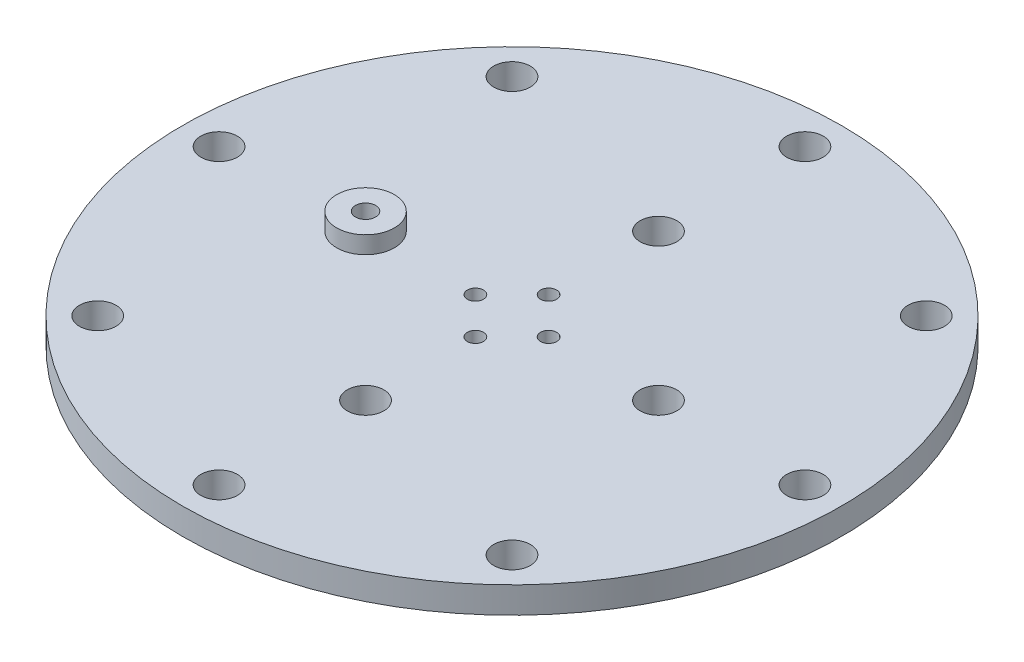
ISO-10303-21;
HEADER;
FILE_DESCRIPTION(('STEP AP214'),'2;1');
FILE_NAME('part.step','',(''),(''),'','','');
FILE_SCHEMA(('AUTOMOTIVE_DESIGN { 1 0 10303 214 1 1 1 1 }'));
ENDSEC;
DATA;
#1=APPLICATION_CONTEXT('core data for automotive mechanical design processes');
#2=APPLICATION_PROTOCOL_DEFINITION('international standard','automotive_design',2000,#1);
#3=PRODUCT_CONTEXT('',#1,'mechanical');
#4=PRODUCT('Part','Part','',(#3));
#5=PRODUCT_RELATED_PRODUCT_CATEGORY('part','',(#4));
#6=PRODUCT_DEFINITION_FORMATION('','',#4);
#7=PRODUCT_DEFINITION_CONTEXT('part definition',#1,'design');
#8=PRODUCT_DEFINITION('design','',#6,#7);
#9=PRODUCT_DEFINITION_SHAPE('','',#8);
#10=(LENGTH_UNIT() NAMED_UNIT(*) SI_UNIT(.MILLI.,.METRE.));
#11=(NAMED_UNIT(*) PLANE_ANGLE_UNIT() SI_UNIT($,.RADIAN.));
#12=(NAMED_UNIT(*) SI_UNIT($,.STERADIAN.) SOLID_ANGLE_UNIT());
#13=UNCERTAINTY_MEASURE_WITH_UNIT(LENGTH_MEASURE(1.E-05),#10,'distance_accuracy_value','');
#14=(GEOMETRIC_REPRESENTATION_CONTEXT(3) GLOBAL_UNCERTAINTY_ASSIGNED_CONTEXT((#13)) GLOBAL_UNIT_ASSIGNED_CONTEXT((#10,
#11,#12)) REPRESENTATION_CONTEXT('',''));
#15=CARTESIAN_POINT('',(0.,0.,0.));
#16=DIRECTION('',(0.,0.,1.));
#17=DIRECTION('',(1.,0.,0.));
#18=AXIS2_PLACEMENT_3D('',#15,#16,#17);
#19=CARTESIAN_POINT('',(-25.4,2.572,-2.66050878019847E-13));
#20=DIRECTION('',(0.,1.,0.));
#21=DIRECTION('',(0.,0.,1.));
#22=AXIS2_PLACEMENT_3D('',#19,#20,#21);
#23=CYLINDRICAL_SURFACE('',#22,2.75);
#24=CARTESIAN_POINT('',(-25.4,2.572,-2.66050878019847E-13));
#25=DIRECTION('',(0.,1.,0.));
#26=DIRECTION('',(0.,0.,1.));
#27=AXIS2_PLACEMENT_3D('',#24,#25,#26);
#28=CIRCLE('',#27,2.75);
#29=CARTESIAN_POINT('',(-25.4,2.572,2.74999999999973));
#30=VERTEX_POINT('',#29);
#31=EDGE_CURVE('E11',#30,#30,#28,.T.);
#32=ORIENTED_EDGE('',*,*,#31,.T.);
#33=EDGE_LOOP('',(#32));
#34=FACE_BOUND('',#33,.T.);
#35=CARTESIAN_POINT('',(-25.4,4.572,-2.66050878019847E-13));
#36=DIRECTION('',(0.,1.,0.));
#37=DIRECTION('',(0.,0.,1.));
#38=AXIS2_PLACEMENT_3D('',#35,#36,#37);
#39=CIRCLE('',#38,2.75);
#40=CARTESIAN_POINT('',(-25.4,4.572,2.74999999999973));
#41=VERTEX_POINT('',#40);
#42=EDGE_CURVE('E48',#41,#41,#39,.T.);
#43=ORIENTED_EDGE('',*,*,#42,.F.);
#44=EDGE_LOOP('',(#43));
#45=FACE_BOUND('',#44,.T.);
#46=ADVANCED_FACE('F45',(#34,#45),#23,.T.);
#47=CARTESIAN_POINT('',(-25.4,2.572,-2.66050878019847E-13));
#48=DIRECTION('',(0.,1.,0.));
#49=DIRECTION('',(0.,0.,1.));
#50=AXIS2_PLACEMENT_3D('',#47,#48,#49);
#51=PLANE('',#50);
#52=CARTESIAN_POINT('',(-25.4,2.572,-2.66050878019847E-13));
#53=DIRECTION('',(0.,1.,0.));
#54=DIRECTION('',(0.,0.,1.));
#55=AXIS2_PLACEMENT_3D('',#52,#53,#54);
#56=CIRCLE('',#55,1.75);
#57=CARTESIAN_POINT('',(-25.4,2.572,1.74999999999973));
#58=VERTEX_POINT('',#57);
#59=EDGE_CURVE('E55',#58,#58,#56,.T.);
#60=ORIENTED_EDGE('',*,*,#59,.T.);
#61=EDGE_LOOP('',(#60));
#62=FACE_BOUND('',#61,.T.);
#63=ORIENTED_EDGE('',*,*,#31,.F.);
#64=EDGE_LOOP('',(#63));
#65=FACE_BOUND('',#64,.T.);
#66=ADVANCED_FACE('F83',(#62,#65),#51,.F.);
#67=CARTESIAN_POINT('',(-25.4,2.572,-2.66050878019847E-13));
#68=DIRECTION('',(0.,1.,0.));
#69=DIRECTION('',(0.,0.,1.));
#70=AXIS2_PLACEMENT_3D('',#67,#68,#69);
#71=CYLINDRICAL_SURFACE('',#70,1.75);
#72=ORIENTED_EDGE('',*,*,#59,.F.);
#73=EDGE_LOOP('',(#72));
#74=FACE_BOUND('',#73,.T.);
#75=CARTESIAN_POINT('',(-25.4,7.572,-2.66050878019847E-13));
#76=DIRECTION('',(0.,1.,0.));
#77=DIRECTION('',(0.,0.,1.));
#78=AXIS2_PLACEMENT_3D('',#75,#76,#77);
#79=CIRCLE('',#78,1.75);
#80=CARTESIAN_POINT('',(-25.4,7.572,1.74999999999973));
#81=VERTEX_POINT('',#80);
#82=EDGE_CURVE('E63',#81,#81,#79,.T.);
#83=ORIENTED_EDGE('',*,*,#82,.T.);
#84=EDGE_LOOP('',(#83));
#85=FACE_BOUND('',#84,.T.);
#86=ADVANCED_FACE('F69',(#74,#85),#71,.F.);
#87=CARTESIAN_POINT('',(-25.4,7.572,-2.66050878019847E-13));
#88=DIRECTION('',(0.,1.,0.));
#89=DIRECTION('',(0.,0.,1.));
#90=AXIS2_PLACEMENT_3D('',#87,#88,#89);
#91=PLANE('',#90);
#92=CARTESIAN_POINT('',(-25.4,7.572,-2.66050878019847E-13));
#93=DIRECTION('',(0.,1.,0.));
#94=DIRECTION('',(0.,0.,1.));
#95=AXIS2_PLACEMENT_3D('',#92,#93,#94);
#96=CIRCLE('',#95,5.);
#97=CARTESIAN_POINT('',(-25.4,7.572,4.99999999999973));
#98=VERTEX_POINT('',#97);
#99=EDGE_CURVE('E59',#98,#98,#96,.T.);
#100=ORIENTED_EDGE('',*,*,#99,.T.);
#101=EDGE_LOOP('',(#100));
#102=FACE_BOUND('',#101,.T.);
#103=ORIENTED_EDGE('',*,*,#82,.F.);
#104=EDGE_LOOP('',(#103));
#105=FACE_BOUND('',#104,.T.);
#106=ADVANCED_FACE('F71',(#102,#105),#91,.T.);
#107=CARTESIAN_POINT('',(-25.4,4.572,-2.66050878019847E-13));
#108=DIRECTION('',(0.,1.,0.));
#109=DIRECTION('',(0.,0.,1.));
#110=AXIS2_PLACEMENT_3D('',#107,#108,#109);
#111=PLANE('',#110);
#112=ORIENTED_EDGE('',*,*,#42,.T.);
#113=EDGE_LOOP('',(#112));
#114=FACE_BOUND('',#113,.T.);
#115=CARTESIAN_POINT('',(-25.4,4.572,-2.66050878019847E-13));
#116=DIRECTION('',(0.,1.,0.));
#117=DIRECTION('',(0.,0.,1.));
#118=AXIS2_PLACEMENT_3D('',#115,#116,#117);
#119=CIRCLE('',#118,5.);
#120=CARTESIAN_POINT('',(-25.4,4.572,4.99999999999973));
#121=VERTEX_POINT('',#120);
#122=EDGE_CURVE('E60',#121,#121,#119,.T.);
#123=ORIENTED_EDGE('',*,*,#122,.F.);
#124=EDGE_LOOP('',(#123));
#125=FACE_BOUND('',#124,.T.);
#126=ADVANCED_FACE('F73',(#114,#125),#111,.F.);
#127=CARTESIAN_POINT('',(-25.4,7.572,-2.66050878019847E-13));
#128=DIRECTION('',(0.,-1.,0.));
#129=DIRECTION('',(0.,0.,-1.));
#130=AXIS2_PLACEMENT_3D('',#127,#128,#129);
#131=CYLINDRICAL_SURFACE('',#130,5.);
#132=ORIENTED_EDGE('',*,*,#99,.F.);
#133=EDGE_LOOP('',(#132));
#134=FACE_BOUND('',#133,.T.);
#135=ORIENTED_EDGE('',*,*,#122,.T.);
#136=EDGE_LOOP('',(#135));
#137=FACE_BOUND('',#136,.T.);
#138=ADVANCED_FACE('F80',(#134,#137),#131,.T.);
#139=CLOSED_SHELL('',(#46,#66,#86,#106,#126,#138));
#140=MANIFOLD_SOLID_BREP('B2',#139);
#141=CARTESIAN_POINT('',(0.,4.572,0.));
#142=DIRECTION('',(0.,1.,0.));
#143=DIRECTION('',(0.,0.,1.));
#144=AXIS2_PLACEMENT_3D('',#141,#142,#143);
#145=PLANE('',#144);
#146=CARTESIAN_POINT('',(-50.7999999999978,4.572,2.16262365572695E-12));
#147=DIRECTION('',(0.,1.,0.));
#148=DIRECTION('',(0.,0.,1.));
#149=AXIS2_PLACEMENT_3D('',#146,#147,#148);
#150=CIRCLE('',#149,3.17500000000321);
#151=CARTESIAN_POINT('',(-50.7999999999978,4.572,3.17500000000537));
#152=VERTEX_POINT('',#151);
#153=EDGE_CURVE('E234',#152,#152,#150,.T.);
#154=ORIENTED_EDGE('',*,*,#153,.F.);
#155=EDGE_LOOP('',(#154));
#156=FACE_BOUND('',#155,.T.);
#157=CARTESIAN_POINT('',(4.31280489997456E-12,4.572,50.8));
#158=DIRECTION('',(0.,1.,0.));
#159=DIRECTION('',(0.,0.,1.));
#160=AXIS2_PLACEMENT_3D('',#157,#158,#159);
#161=CIRCLE('',#160,3.17500000000446);
#162=CARTESIAN_POINT('',(4.31280489997456E-12,4.572,53.9750000000045));
#163=VERTEX_POINT('',#162);
#164=EDGE_CURVE('E222',#163,#163,#161,.T.);
#165=ORIENTED_EDGE('',*,*,#164,.F.);
#166=EDGE_LOOP('',(#165));
#167=FACE_BOUND('',#166,.T.);
#168=CARTESIAN_POINT('',(50.8000000000022,4.572,-2.15640244998728E-12));
#169=DIRECTION('',(0.,1.,0.));
#170=DIRECTION('',(0.,0.,1.));
#171=AXIS2_PLACEMENT_3D('',#168,#169,#170);
#172=CIRCLE('',#171,3.1750000000016);
#173=CARTESIAN_POINT('',(50.8000000000022,4.572,3.17499999999944));
#174=VERTEX_POINT('',#173);
#175=EDGE_CURVE('E210',#174,#174,#172,.T.);
#176=ORIENTED_EDGE('',*,*,#175,.F.);
#177=EDGE_LOOP('',(#176));
#178=FACE_BOUND('',#177,.T.);
#179=CARTESIAN_POINT('',(-6.35,4.572,0.));
#180=DIRECTION('',(0.,1.,0.));
#181=DIRECTION('',(0.,0.,1.));
#182=AXIS2_PLACEMENT_3D('',#179,#180,#181);
#183=CIRCLE('',#182,1.397);
#184=CARTESIAN_POINT('',(-6.35,4.572,1.39699999999993));
#185=VERTEX_POINT('',#184);
#186=EDGE_CURVE('E198',#185,#185,#183,.T.);
#187=ORIENTED_EDGE('',*,*,#186,.F.);
#188=EDGE_LOOP('',(#187));
#189=FACE_BOUND('',#188,.T.);
#190=CARTESIAN_POINT('',(6.35,4.572,0.));
#191=DIRECTION('',(0.,1.,0.));
#192=DIRECTION('',(0.,0.,1.));
#193=AXIS2_PLACEMENT_3D('',#190,#191,#192);
#194=CIRCLE('',#193,1.397);
#195=CARTESIAN_POINT('',(6.35,4.572,1.39700000000002));
#196=VERTEX_POINT('',#195);
#197=EDGE_CURVE('E186',#196,#196,#194,.T.);
#198=ORIENTED_EDGE('',*,*,#197,.F.);
#199=EDGE_LOOP('',(#198));
#200=FACE_BOUND('',#199,.T.);
#201=CARTESIAN_POINT('',(1.43449103045502E-12,4.572,25.4));
#202=DIRECTION('',(0.,1.,0.));
#203=DIRECTION('',(0.,0.,1.));
#204=AXIS2_PLACEMENT_3D('',#201,#202,#203);
#205=CIRCLE('',#204,3.17500000000154);
#206=CARTESIAN_POINT('',(1.43449103045502E-12,4.572,28.5750000000015));
#207=VERTEX_POINT('',#206);
#208=EDGE_CURVE('E174',#207,#207,#205,.T.);
#209=ORIENTED_EDGE('',*,*,#208,.F.);
#210=EDGE_LOOP('',(#209));
#211=FACE_BOUND('',#210,.T.);
#212=CARTESIAN_POINT('',(0.,4.572,-50.8));
#213=DIRECTION('',(0.,1.,0.));
#214=DIRECTION('',(0.,0.,1.));
#215=AXIS2_PLACEMENT_3D('',#212,#213,#214);
#216=CIRCLE('',#215,3.175);
#217=CARTESIAN_POINT('',(0.,4.572,-47.625));
#218=VERTEX_POINT('',#217);
#219=EDGE_CURVE('E162',#218,#218,#216,.T.);
#220=ORIENTED_EDGE('',*,*,#219,.F.);
#221=EDGE_LOOP('',(#220));
#222=FACE_BOUND('',#221,.T.);
#223=CARTESIAN_POINT('',(0.,4.572,-6.35));
#224=DIRECTION('',(0.,1.,0.));
#225=DIRECTION('',(0.,0.,1.));
#226=AXIS2_PLACEMENT_3D('',#223,#224,#225);
#227=CIRCLE('',#226,1.397);
#228=CARTESIAN_POINT('',(0.,4.572,-4.953));
#229=VERTEX_POINT('',#228);
#230=EDGE_CURVE('E151',#229,#229,#227,.T.);
#231=ORIENTED_EDGE('',*,*,#230,.F.);
#232=EDGE_LOOP('',(#231));
#233=FACE_BOUND('',#232,.T.);
#234=CARTESIAN_POINT('',(0.,4.572,0.));
#235=DIRECTION('',(0.,1.,0.));
#236=DIRECTION('',(0.,0.,1.));
#237=AXIS2_PLACEMENT_3D('',#234,#235,#236);
#238=CIRCLE('',#237,57.15);
#239=CARTESIAN_POINT('',(0.,4.572,57.15));
#240=VERTEX_POINT('',#239);
#241=EDGE_CURVE('E44',#240,#240,#238,.T.);
#242=ORIENTED_EDGE('',*,*,#241,.T.);
#243=EDGE_LOOP('',(#242));
#244=FACE_BOUND('',#243,.T.);
#245=CARTESIAN_POINT('',(0.,4.572,-25.4));
#246=DIRECTION('',(0.,1.,0.));
#247=DIRECTION('',(0.,0.,1.));
#248=AXIS2_PLACEMENT_3D('',#245,#246,#247);
#249=CIRCLE('',#248,3.175);
#250=CARTESIAN_POINT('',(0.,4.572,-22.225));
#251=VERTEX_POINT('',#250);
#252=EDGE_CURVE('E156',#251,#251,#249,.T.);
#253=ORIENTED_EDGE('',*,*,#252,.F.);
#254=EDGE_LOOP('',(#253));
#255=FACE_BOUND('',#254,.T.);
#256=CARTESIAN_POINT('',(25.4,4.572,0.));
#257=DIRECTION('',(0.,1.,0.));
#258=DIRECTION('',(0.,0.,1.));
#259=AXIS2_PLACEMENT_3D('',#256,#257,#258);
#260=CIRCLE('',#259,3.175);
#261=CARTESIAN_POINT('',(25.4,4.572,3.17500000000009));
#262=VERTEX_POINT('',#261);
#263=EDGE_CURVE('E168',#262,#262,#260,.T.);
#264=ORIENTED_EDGE('',*,*,#263,.F.);
#265=EDGE_LOOP('',(#264));
#266=FACE_BOUND('',#265,.T.);
#267=CARTESIAN_POINT('',(-25.4,4.572,-2.66050878019847E-13));
#268=DIRECTION('',(0.,1.,0.));
#269=DIRECTION('',(0.,0.,1.));
#270=AXIS2_PLACEMENT_3D('',#267,#268,#269);
#271=CIRCLE('',#270,3.175);
#272=CARTESIAN_POINT('',(-25.4,4.572,3.17499999999973));
#273=VERTEX_POINT('',#272);
#274=EDGE_CURVE('E180',#273,#273,#271,.T.);
#275=ORIENTED_EDGE('',*,*,#274,.F.);
#276=EDGE_LOOP('',(#275));
#277=FACE_BOUND('',#276,.T.);
#278=CARTESIAN_POINT('',(0.,4.572,6.35));
#279=DIRECTION('',(0.,1.,0.));
#280=DIRECTION('',(0.,0.,1.));
#281=AXIS2_PLACEMENT_3D('',#278,#279,#280);
#282=CIRCLE('',#281,1.397);
#283=CARTESIAN_POINT('',(0.,4.572,7.747));
#284=VERTEX_POINT('',#283);
#285=EDGE_CURVE('E192',#284,#284,#282,.T.);
#286=ORIENTED_EDGE('',*,*,#285,.F.);
#287=EDGE_LOOP('',(#286));
#288=FACE_BOUND('',#287,.T.);
#289=CARTESIAN_POINT('',(35.9210244842772,4.572,-35.9210244842781));
#290=DIRECTION('',(0.,1.,0.));
#291=DIRECTION('',(0.,0.,1.));
#292=AXIS2_PLACEMENT_3D('',#289,#290,#291);
#293=CIRCLE('',#292,3.17500000000024);
#294=CARTESIAN_POINT('',(35.9210244842772,4.572,-32.7460244842779));
#295=VERTEX_POINT('',#294);
#296=EDGE_CURVE('E204',#295,#295,#293,.T.);
#297=ORIENTED_EDGE('',*,*,#296,.F.);
#298=EDGE_LOOP('',(#297));
#299=FACE_BOUND('',#298,.T.);
#300=CARTESIAN_POINT('',(35.9210244842803,4.572,35.9210244842751));
#301=DIRECTION('',(0.,1.,0.));
#302=DIRECTION('',(0.,0.,1.));
#303=AXIS2_PLACEMENT_3D('',#300,#301,#302);
#304=CIRCLE('',#303,3.17500000000333);
#305=CARTESIAN_POINT('',(35.9210244842803,4.572,39.0960244842784));
#306=VERTEX_POINT('',#305);
#307=EDGE_CURVE('E216',#306,#306,#304,.T.);
#308=ORIENTED_EDGE('',*,*,#307,.F.);
#309=EDGE_LOOP('',(#308));
#310=FACE_BOUND('',#309,.T.);
#311=CARTESIAN_POINT('',(-35.9210244842729,4.572,35.9210244842781));
#312=DIRECTION('',(0.,1.,0.));
#313=DIRECTION('',(0.,0.,1.));
#314=AXIS2_PLACEMENT_3D('',#311,#312,#313);
#315=CIRCLE('',#314,3.1750000000044);
#316=CARTESIAN_POINT('',(-35.9210244842729,4.572,39.0960244842825));
#317=VERTEX_POINT('',#316);
#318=EDGE_CURVE('E228',#317,#317,#315,.T.);
#319=ORIENTED_EDGE('',*,*,#318,.F.);
#320=EDGE_LOOP('',(#319));
#321=FACE_BOUND('',#320,.T.);
#322=CARTESIAN_POINT('',(-35.921024484276,4.572,-35.9210244842751));
#323=DIRECTION('',(0.,1.,0.));
#324=DIRECTION('',(0.,0.,1.));
#325=AXIS2_PLACEMENT_3D('',#322,#323,#324);
#326=CIRCLE('',#325,3.17500000000165);
#327=CARTESIAN_POINT('',(-35.921024484276,4.572,-32.7460244842734));
#328=VERTEX_POINT('',#327);
#329=EDGE_CURVE('E240',#328,#328,#326,.T.);
#330=ORIENTED_EDGE('',*,*,#329,.F.);
#331=EDGE_LOOP('',(#330));
#332=FACE_BOUND('',#331,.T.);
#333=ADVANCED_FACE('F140',(#156,#167,#178,#189,#200,#211,#222,#233,#244,#255,#266,#277,#288,
#299,#310,#321,#332),#145,.T.);
#334=CARTESIAN_POINT('',(0.,0.,0.));
#335=DIRECTION('',(0.,1.,0.));
#336=DIRECTION('',(0.,0.,1.));
#337=AXIS2_PLACEMENT_3D('',#334,#335,#336);
#338=PLANE('',#337);
#339=CARTESIAN_POINT('',(0.,0.,0.));
#340=DIRECTION('',(0.,1.,0.));
#341=DIRECTION('',(0.,0.,1.));
#342=AXIS2_PLACEMENT_3D('',#339,#340,#341);
#343=CIRCLE('',#342,57.15);
#344=CARTESIAN_POINT('',(0.,0.,57.15));
#345=VERTEX_POINT('',#344);
#346=EDGE_CURVE('E144',#345,#345,#343,.T.);
#347=ORIENTED_EDGE('',*,*,#346,.F.);
#348=EDGE_LOOP('',(#347));
#349=FACE_BOUND('',#348,.T.);
#350=CARTESIAN_POINT('',(0.,0.,-6.35));
#351=DIRECTION('',(0.,1.,0.));
#352=DIRECTION('',(0.,0.,1.));
#353=AXIS2_PLACEMENT_3D('',#350,#351,#352);
#354=CIRCLE('',#353,1.397);
#355=CARTESIAN_POINT('',(0.,0.,-4.953));
#356=VERTEX_POINT('',#355);
#357=EDGE_CURVE('E153',#356,#356,#354,.T.);
#358=ORIENTED_EDGE('',*,*,#357,.T.);
#359=EDGE_LOOP('',(#358));
#360=FACE_BOUND('',#359,.T.);
#361=CARTESIAN_POINT('',(0.,0.,-25.4));
#362=DIRECTION('',(0.,1.,0.));
#363=DIRECTION('',(0.,0.,1.));
#364=AXIS2_PLACEMENT_3D('',#361,#362,#363);
#365=CIRCLE('',#364,3.175);
#366=CARTESIAN_POINT('',(0.,0.,-22.225));
#367=VERTEX_POINT('',#366);
#368=EDGE_CURVE('E159',#367,#367,#365,.T.);
#369=ORIENTED_EDGE('',*,*,#368,.T.);
#370=EDGE_LOOP('',(#369));
#371=FACE_BOUND('',#370,.T.);
#372=CARTESIAN_POINT('',(0.,0.,-50.8));
#373=DIRECTION('',(0.,1.,0.));
#374=DIRECTION('',(0.,0.,1.));
#375=AXIS2_PLACEMENT_3D('',#372,#373,#374);
#376=CIRCLE('',#375,3.175);
#377=CARTESIAN_POINT('',(0.,0.,-47.625));
#378=VERTEX_POINT('',#377);
#379=EDGE_CURVE('E165',#378,#378,#376,.T.);
#380=ORIENTED_EDGE('',*,*,#379,.T.);
#381=EDGE_LOOP('',(#380));
#382=FACE_BOUND('',#381,.T.);
#383=CARTESIAN_POINT('',(25.4,0.,0.));
#384=DIRECTION('',(0.,1.,0.));
#385=DIRECTION('',(0.,0.,1.));
#386=AXIS2_PLACEMENT_3D('',#383,#384,#385);
#387=CIRCLE('',#386,3.175);
#388=CARTESIAN_POINT('',(25.4,0.,3.17500000000009));
#389=VERTEX_POINT('',#388);
#390=EDGE_CURVE('E171',#389,#389,#387,.T.);
#391=ORIENTED_EDGE('',*,*,#390,.T.);
#392=EDGE_LOOP('',(#391));
#393=FACE_BOUND('',#392,.T.);
#394=CARTESIAN_POINT('',(1.43449103045502E-12,0.,25.4));
#395=DIRECTION('',(0.,1.,0.));
#396=DIRECTION('',(0.,0.,1.));
#397=AXIS2_PLACEMENT_3D('',#394,#395,#396);
#398=CIRCLE('',#397,3.17500000000154);
#399=CARTESIAN_POINT('',(1.43449103045502E-12,0.,28.5750000000015));
#400=VERTEX_POINT('',#399);
#401=EDGE_CURVE('E177',#400,#400,#398,.T.);
#402=ORIENTED_EDGE('',*,*,#401,.T.);
#403=EDGE_LOOP('',(#402));
#404=FACE_BOUND('',#403,.T.);
#405=CARTESIAN_POINT('',(-25.4,0.,-2.66050878019847E-13));
#406=DIRECTION('',(0.,1.,0.));
#407=DIRECTION('',(0.,0.,1.));
#408=AXIS2_PLACEMENT_3D('',#405,#406,#407);
#409=CIRCLE('',#408,3.175);
#410=CARTESIAN_POINT('',(-25.4,0.,3.17499999999973));
#411=VERTEX_POINT('',#410);
#412=EDGE_CURVE('E183',#411,#411,#409,.T.);
#413=ORIENTED_EDGE('',*,*,#412,.T.);
#414=EDGE_LOOP('',(#413));
#415=FACE_BOUND('',#414,.T.);
#416=CARTESIAN_POINT('',(6.35,0.,0.));
#417=DIRECTION('',(0.,1.,0.));
#418=DIRECTION('',(0.,0.,1.));
#419=AXIS2_PLACEMENT_3D('',#416,#417,#418);
#420=CIRCLE('',#419,1.397);
#421=CARTESIAN_POINT('',(6.35,0.,1.39700000000002));
#422=VERTEX_POINT('',#421);
#423=EDGE_CURVE('E189',#422,#422,#420,.T.);
#424=ORIENTED_EDGE('',*,*,#423,.T.);
#425=EDGE_LOOP('',(#424));
#426=FACE_BOUND('',#425,.T.);
#427=CARTESIAN_POINT('',(0.,0.,6.35));
#428=DIRECTION('',(0.,1.,0.));
#429=DIRECTION('',(0.,0.,1.));
#430=AXIS2_PLACEMENT_3D('',#427,#428,#429);
#431=CIRCLE('',#430,1.397);
#432=CARTESIAN_POINT('',(0.,0.,7.747));
#433=VERTEX_POINT('',#432);
#434=EDGE_CURVE('E195',#433,#433,#431,.T.);
#435=ORIENTED_EDGE('',*,*,#434,.T.);
#436=EDGE_LOOP('',(#435));
#437=FACE_BOUND('',#436,.T.);
#438=CARTESIAN_POINT('',(-6.35,0.,0.));
#439=DIRECTION('',(0.,1.,0.));
#440=DIRECTION('',(0.,0.,1.));
#441=AXIS2_PLACEMENT_3D('',#438,#439,#440);
#442=CIRCLE('',#441,1.397);
#443=CARTESIAN_POINT('',(-6.35,0.,1.39699999999993));
#444=VERTEX_POINT('',#443);
#445=EDGE_CURVE('E201',#444,#444,#442,.T.);
#446=ORIENTED_EDGE('',*,*,#445,.T.);
#447=EDGE_LOOP('',(#446));
#448=FACE_BOUND('',#447,.T.);
#449=CARTESIAN_POINT('',(35.9210244842772,0.,-35.9210244842781));
#450=DIRECTION('',(0.,1.,0.));
#451=DIRECTION('',(0.,0.,1.));
#452=AXIS2_PLACEMENT_3D('',#449,#450,#451);
#453=CIRCLE('',#452,3.17500000000024);
#454=CARTESIAN_POINT('',(35.9210244842772,0.,-32.7460244842779));
#455=VERTEX_POINT('',#454);
#456=EDGE_CURVE('E207',#455,#455,#453,.T.);
#457=ORIENTED_EDGE('',*,*,#456,.T.);
#458=EDGE_LOOP('',(#457));
#459=FACE_BOUND('',#458,.T.);
#460=CARTESIAN_POINT('',(50.8000000000022,0.,-2.15640244998728E-12));
#461=DIRECTION('',(0.,1.,0.));
#462=DIRECTION('',(0.,0.,1.));
#463=AXIS2_PLACEMENT_3D('',#460,#461,#462);
#464=CIRCLE('',#463,3.1750000000016);
#465=CARTESIAN_POINT('',(50.8000000000022,0.,3.17499999999944));
#466=VERTEX_POINT('',#465);
#467=EDGE_CURVE('E213',#466,#466,#464,.T.);
#468=ORIENTED_EDGE('',*,*,#467,.T.);
#469=EDGE_LOOP('',(#468));
#470=FACE_BOUND('',#469,.T.);
#471=CARTESIAN_POINT('',(35.9210244842803,0.,35.9210244842751));
#472=DIRECTION('',(0.,1.,0.));
#473=DIRECTION('',(0.,0.,1.));
#474=AXIS2_PLACEMENT_3D('',#471,#472,#473);
#475=CIRCLE('',#474,3.17500000000333);
#476=CARTESIAN_POINT('',(35.9210244842803,0.,39.0960244842784));
#477=VERTEX_POINT('',#476);
#478=EDGE_CURVE('E219',#477,#477,#475,.T.);
#479=ORIENTED_EDGE('',*,*,#478,.T.);
#480=EDGE_LOOP('',(#479));
#481=FACE_BOUND('',#480,.T.);
#482=CARTESIAN_POINT('',(4.31280489997456E-12,0.,50.8));
#483=DIRECTION('',(0.,1.,0.));
#484=DIRECTION('',(0.,0.,1.));
#485=AXIS2_PLACEMENT_3D('',#482,#483,#484);
#486=CIRCLE('',#485,3.17500000000446);
#487=CARTESIAN_POINT('',(4.31280489997456E-12,0.,53.9750000000045));
#488=VERTEX_POINT('',#487);
#489=EDGE_CURVE('E225',#488,#488,#486,.T.);
#490=ORIENTED_EDGE('',*,*,#489,.T.);
#491=EDGE_LOOP('',(#490));
#492=FACE_BOUND('',#491,.T.);
#493=CARTESIAN_POINT('',(-35.9210244842729,0.,35.9210244842781));
#494=DIRECTION('',(0.,1.,0.));
#495=DIRECTION('',(0.,0.,1.));
#496=AXIS2_PLACEMENT_3D('',#493,#494,#495);
#497=CIRCLE('',#496,3.1750000000044);
#498=CARTESIAN_POINT('',(-35.9210244842729,0.,39.0960244842825));
#499=VERTEX_POINT('',#498);
#500=EDGE_CURVE('E231',#499,#499,#497,.T.);
#501=ORIENTED_EDGE('',*,*,#500,.T.);
#502=EDGE_LOOP('',(#501));
#503=FACE_BOUND('',#502,.T.);
#504=CARTESIAN_POINT('',(-50.7999999999978,0.,2.16262365572695E-12));
#505=DIRECTION('',(0.,1.,0.));
#506=DIRECTION('',(0.,0.,1.));
#507=AXIS2_PLACEMENT_3D('',#504,#505,#506);
#508=CIRCLE('',#507,3.17500000000321);
#509=CARTESIAN_POINT('',(-50.7999999999978,0.,3.17500000000537));
#510=VERTEX_POINT('',#509);
#511=EDGE_CURVE('E237',#510,#510,#508,.T.);
#512=ORIENTED_EDGE('',*,*,#511,.T.);
#513=EDGE_LOOP('',(#512));
#514=FACE_BOUND('',#513,.T.);
#515=CARTESIAN_POINT('',(-35.921024484276,0.,-35.9210244842751));
#516=DIRECTION('',(0.,1.,0.));
#517=DIRECTION('',(0.,0.,1.));
#518=AXIS2_PLACEMENT_3D('',#515,#516,#517);
#519=CIRCLE('',#518,3.17500000000165);
#520=CARTESIAN_POINT('',(-35.921024484276,0.,-32.7460244842734));
#521=VERTEX_POINT('',#520);
#522=EDGE_CURVE('E243',#521,#521,#519,.T.);
#523=ORIENTED_EDGE('',*,*,#522,.T.);
#524=EDGE_LOOP('',(#523));
#525=FACE_BOUND('',#524,.T.);
#526=ADVANCED_FACE('F253',(#349,#360,#371,#382,#393,#404,#415,#426,#437,#448,#459,#470,#481,
#492,#503,#514,#525),#338,.F.);
#527=CARTESIAN_POINT('',(0.,4.572,0.));
#528=DIRECTION('',(0.,-1.,0.));
#529=DIRECTION('',(0.,0.,-1.));
#530=AXIS2_PLACEMENT_3D('',#527,#528,#529);
#531=CYLINDRICAL_SURFACE('',#530,57.15);
#532=ORIENTED_EDGE('',*,*,#241,.F.);
#533=EDGE_LOOP('',(#532));
#534=FACE_BOUND('',#533,.T.);
#535=ORIENTED_EDGE('',*,*,#346,.T.);
#536=EDGE_LOOP('',(#535));
#537=FACE_BOUND('',#536,.T.);
#538=ADVANCED_FACE('F142',(#534,#537),#531,.T.);
#539=CARTESIAN_POINT('',(0.,4.572,-6.35));
#540=DIRECTION('',(0.,-1.,0.));
#541=DIRECTION('',(0.,0.,-1.));
#542=AXIS2_PLACEMENT_3D('',#539,#540,#541);
#543=CYLINDRICAL_SURFACE('',#542,1.397);
#544=ORIENTED_EDGE('',*,*,#230,.T.);
#545=EDGE_LOOP('',(#544));
#546=FACE_BOUND('',#545,.T.);
#547=ORIENTED_EDGE('',*,*,#357,.F.);
#548=EDGE_LOOP('',(#547));
#549=FACE_BOUND('',#548,.T.);
#550=ADVANCED_FACE('F263',(#546,#549),#543,.F.);
#551=CARTESIAN_POINT('',(0.,4.572,-25.4));
#552=DIRECTION('',(0.,-1.,0.));
#553=DIRECTION('',(0.,0.,-1.));
#554=AXIS2_PLACEMENT_3D('',#551,#552,#553);
#555=CYLINDRICAL_SURFACE('',#554,3.175);
#556=ORIENTED_EDGE('',*,*,#252,.T.);
#557=EDGE_LOOP('',(#556));
#558=FACE_BOUND('',#557,.T.);
#559=ORIENTED_EDGE('',*,*,#368,.F.);
#560=EDGE_LOOP('',(#559));
#561=FACE_BOUND('',#560,.T.);
#562=ADVANCED_FACE('F266',(#558,#561),#555,.F.);
#563=CARTESIAN_POINT('',(0.,4.572,-50.8));
#564=DIRECTION('',(0.,-1.,0.));
#565=DIRECTION('',(0.,0.,-1.));
#566=AXIS2_PLACEMENT_3D('',#563,#564,#565);
#567=CYLINDRICAL_SURFACE('',#566,3.175);
#568=ORIENTED_EDGE('',*,*,#219,.T.);
#569=EDGE_LOOP('',(#568));
#570=FACE_BOUND('',#569,.T.);
#571=ORIENTED_EDGE('',*,*,#379,.F.);
#572=EDGE_LOOP('',(#571));
#573=FACE_BOUND('',#572,.T.);
#574=ADVANCED_FACE('F270',(#570,#573),#567,.F.);
#575=CARTESIAN_POINT('',(25.4,4.572,0.));
#576=DIRECTION('',(0.,-1.,0.));
#577=DIRECTION('',(0.,0.,-1.));
#578=AXIS2_PLACEMENT_3D('',#575,#576,#577);
#579=CYLINDRICAL_SURFACE('',#578,3.175);
#580=ORIENTED_EDGE('',*,*,#263,.T.);
#581=EDGE_LOOP('',(#580));
#582=FACE_BOUND('',#581,.T.);
#583=ORIENTED_EDGE('',*,*,#390,.F.);
#584=EDGE_LOOP('',(#583));
#585=FACE_BOUND('',#584,.T.);
#586=ADVANCED_FACE('F274',(#582,#585),#579,.F.);
#587=CARTESIAN_POINT('',(1.43449103045502E-12,4.572,25.4));
#588=DIRECTION('',(0.,-1.,0.));
#589=DIRECTION('',(0.,0.,-1.));
#590=AXIS2_PLACEMENT_3D('',#587,#588,#589);
#591=CYLINDRICAL_SURFACE('',#590,3.17500000000154);
#592=ORIENTED_EDGE('',*,*,#208,.T.);
#593=EDGE_LOOP('',(#592));
#594=FACE_BOUND('',#593,.T.);
#595=ORIENTED_EDGE('',*,*,#401,.F.);
#596=EDGE_LOOP('',(#595));
#597=FACE_BOUND('',#596,.T.);
#598=ADVANCED_FACE('F278',(#594,#597),#591,.F.);
#599=CARTESIAN_POINT('',(-25.4,4.572,-2.66050878019847E-13));
#600=DIRECTION('',(0.,-1.,0.));
#601=DIRECTION('',(0.,0.,-1.));
#602=AXIS2_PLACEMENT_3D('',#599,#600,#601);
#603=CYLINDRICAL_SURFACE('',#602,3.175);
#604=ORIENTED_EDGE('',*,*,#274,.T.);
#605=EDGE_LOOP('',(#604));
#606=FACE_BOUND('',#605,.T.);
#607=ORIENTED_EDGE('',*,*,#412,.F.);
#608=EDGE_LOOP('',(#607));
#609=FACE_BOUND('',#608,.T.);
#610=ADVANCED_FACE('F282',(#606,#609),#603,.F.);
#611=CARTESIAN_POINT('',(6.35,4.572,0.));
#612=DIRECTION('',(0.,-1.,0.));
#613=DIRECTION('',(0.,0.,-1.));
#614=AXIS2_PLACEMENT_3D('',#611,#612,#613);
#615=CYLINDRICAL_SURFACE('',#614,1.397);
#616=ORIENTED_EDGE('',*,*,#197,.T.);
#617=EDGE_LOOP('',(#616));
#618=FACE_BOUND('',#617,.T.);
#619=ORIENTED_EDGE('',*,*,#423,.F.);
#620=EDGE_LOOP('',(#619));
#621=FACE_BOUND('',#620,.T.);
#622=ADVANCED_FACE('F286',(#618,#621),#615,.F.);
#623=CARTESIAN_POINT('',(0.,4.572,6.35));
#624=DIRECTION('',(0.,-1.,0.));
#625=DIRECTION('',(0.,0.,-1.));
#626=AXIS2_PLACEMENT_3D('',#623,#624,#625);
#627=CYLINDRICAL_SURFACE('',#626,1.397);
#628=ORIENTED_EDGE('',*,*,#285,.T.);
#629=EDGE_LOOP('',(#628));
#630=FACE_BOUND('',#629,.T.);
#631=ORIENTED_EDGE('',*,*,#434,.F.);
#632=EDGE_LOOP('',(#631));
#633=FACE_BOUND('',#632,.T.);
#634=ADVANCED_FACE('F290',(#630,#633),#627,.F.);
#635=CARTESIAN_POINT('',(-6.35,4.572,0.));
#636=DIRECTION('',(0.,-1.,0.));
#637=DIRECTION('',(0.,0.,-1.));
#638=AXIS2_PLACEMENT_3D('',#635,#636,#637);
#639=CYLINDRICAL_SURFACE('',#638,1.397);
#640=ORIENTED_EDGE('',*,*,#186,.T.);
#641=EDGE_LOOP('',(#640));
#642=FACE_BOUND('',#641,.T.);
#643=ORIENTED_EDGE('',*,*,#445,.F.);
#644=EDGE_LOOP('',(#643));
#645=FACE_BOUND('',#644,.T.);
#646=ADVANCED_FACE('F294',(#642,#645),#639,.F.);
#647=CARTESIAN_POINT('',(35.9210244842772,4.572,-35.9210244842781));
#648=DIRECTION('',(0.,-1.,0.));
#649=DIRECTION('',(0.,0.,-1.));
#650=AXIS2_PLACEMENT_3D('',#647,#648,#649);
#651=CYLINDRICAL_SURFACE('',#650,3.17500000000024);
#652=ORIENTED_EDGE('',*,*,#296,.T.);
#653=EDGE_LOOP('',(#652));
#654=FACE_BOUND('',#653,.T.);
#655=ORIENTED_EDGE('',*,*,#456,.F.);
#656=EDGE_LOOP('',(#655));
#657=FACE_BOUND('',#656,.T.);
#658=ADVANCED_FACE('F298',(#654,#657),#651,.F.);
#659=CARTESIAN_POINT('',(50.8000000000022,4.572,-2.15640244998728E-12));
#660=DIRECTION('',(0.,-1.,0.));
#661=DIRECTION('',(0.,0.,-1.));
#662=AXIS2_PLACEMENT_3D('',#659,#660,#661);
#663=CYLINDRICAL_SURFACE('',#662,3.1750000000016);
#664=ORIENTED_EDGE('',*,*,#175,.T.);
#665=EDGE_LOOP('',(#664));
#666=FACE_BOUND('',#665,.T.);
#667=ORIENTED_EDGE('',*,*,#467,.F.);
#668=EDGE_LOOP('',(#667));
#669=FACE_BOUND('',#668,.T.);
#670=ADVANCED_FACE('F302',(#666,#669),#663,.F.);
#671=CARTESIAN_POINT('',(35.9210244842803,4.572,35.9210244842751));
#672=DIRECTION('',(0.,-1.,0.));
#673=DIRECTION('',(0.,0.,-1.));
#674=AXIS2_PLACEMENT_3D('',#671,#672,#673);
#675=CYLINDRICAL_SURFACE('',#674,3.17500000000333);
#676=ORIENTED_EDGE('',*,*,#307,.T.);
#677=EDGE_LOOP('',(#676));
#678=FACE_BOUND('',#677,.T.);
#679=ORIENTED_EDGE('',*,*,#478,.F.);
#680=EDGE_LOOP('',(#679));
#681=FACE_BOUND('',#680,.T.);
#682=ADVANCED_FACE('F306',(#678,#681),#675,.F.);
#683=CARTESIAN_POINT('',(4.31280489997456E-12,4.572,50.8));
#684=DIRECTION('',(0.,-1.,0.));
#685=DIRECTION('',(0.,0.,-1.));
#686=AXIS2_PLACEMENT_3D('',#683,#684,#685);
#687=CYLINDRICAL_SURFACE('',#686,3.17500000000446);
#688=ORIENTED_EDGE('',*,*,#164,.T.);
#689=EDGE_LOOP('',(#688));
#690=FACE_BOUND('',#689,.T.);
#691=ORIENTED_EDGE('',*,*,#489,.F.);
#692=EDGE_LOOP('',(#691));
#693=FACE_BOUND('',#692,.T.);
#694=ADVANCED_FACE('F310',(#690,#693),#687,.F.);
#695=CARTESIAN_POINT('',(-35.9210244842729,4.572,35.9210244842781));
#696=DIRECTION('',(0.,-1.,0.));
#697=DIRECTION('',(0.,0.,-1.));
#698=AXIS2_PLACEMENT_3D('',#695,#696,#697);
#699=CYLINDRICAL_SURFACE('',#698,3.1750000000044);
#700=ORIENTED_EDGE('',*,*,#318,.T.);
#701=EDGE_LOOP('',(#700));
#702=FACE_BOUND('',#701,.T.);
#703=ORIENTED_EDGE('',*,*,#500,.F.);
#704=EDGE_LOOP('',(#703));
#705=FACE_BOUND('',#704,.T.);
#706=ADVANCED_FACE('F314',(#702,#705),#699,.F.);
#707=CARTESIAN_POINT('',(-50.7999999999978,4.572,2.16262365572695E-12));
#708=DIRECTION('',(0.,-1.,0.));
#709=DIRECTION('',(0.,0.,-1.));
#710=AXIS2_PLACEMENT_3D('',#707,#708,#709);
#711=CYLINDRICAL_SURFACE('',#710,3.17500000000321);
#712=ORIENTED_EDGE('',*,*,#153,.T.);
#713=EDGE_LOOP('',(#712));
#714=FACE_BOUND('',#713,.T.);
#715=ORIENTED_EDGE('',*,*,#511,.F.);
#716=EDGE_LOOP('',(#715));
#717=FACE_BOUND('',#716,.T.);
#718=ADVANCED_FACE('F318',(#714,#717),#711,.F.);
#719=CARTESIAN_POINT('',(-35.921024484276,4.572,-35.9210244842751));
#720=DIRECTION('',(0.,-1.,0.));
#721=DIRECTION('',(0.,0.,-1.));
#722=AXIS2_PLACEMENT_3D('',#719,#720,#721);
#723=CYLINDRICAL_SURFACE('',#722,3.17500000000165);
#724=ORIENTED_EDGE('',*,*,#329,.T.);
#725=EDGE_LOOP('',(#724));
#726=FACE_BOUND('',#725,.T.);
#727=ORIENTED_EDGE('',*,*,#522,.F.);
#728=EDGE_LOOP('',(#727));
#729=FACE_BOUND('',#728,.T.);
#730=ADVANCED_FACE('F249',(#726,#729),#723,.F.);
#731=CLOSED_SHELL('',(#333,#526,#538,#550,#562,#574,#586,#598,#610,#622,#634,#646,#658,#670,
#682,#694,#706,#718,#730));
#732=MANIFOLD_SOLID_BREP('B6',#731);
#733=ADVANCED_BREP_SHAPE_REPRESENTATION('',(#18,#140,#732),#14);
#734=SHAPE_DEFINITION_REPRESENTATION(#9,#733);
ENDSEC;
END-ISO-10303-21;
